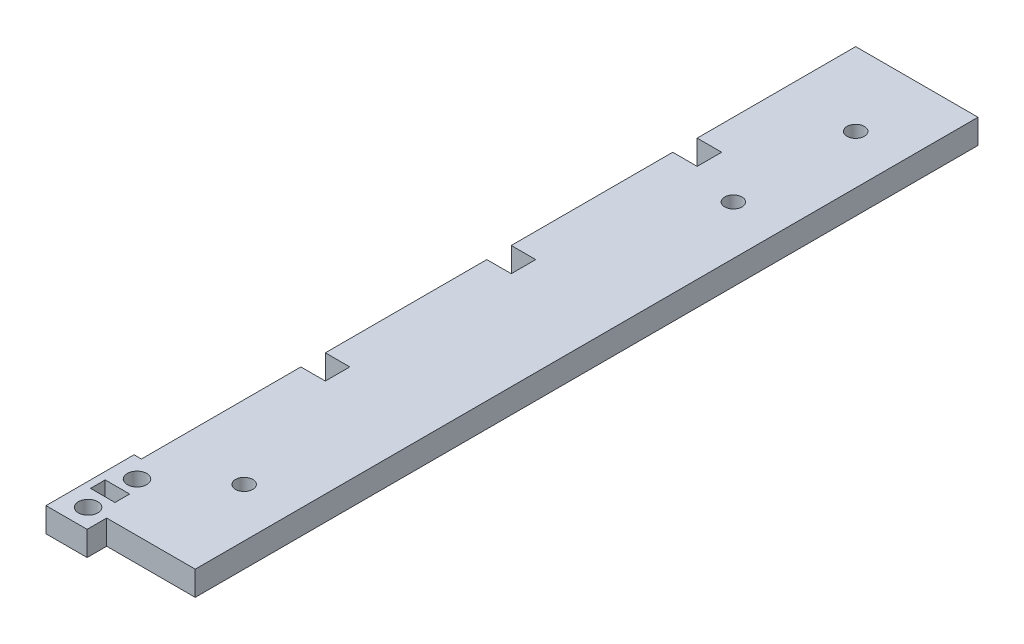
ISO-10303-21;
HEADER;
FILE_DESCRIPTION(('STEP AP214'),'2;1');
FILE_NAME('part.step','',(''),(''),'','','');
FILE_SCHEMA(('AUTOMOTIVE_DESIGN { 1 0 10303 214 1 1 1 1 }'));
ENDSEC;
DATA;
#1=APPLICATION_CONTEXT('core data for automotive mechanical design processes');
#2=APPLICATION_PROTOCOL_DEFINITION('international standard','automotive_design',2000,#1);
#3=PRODUCT_CONTEXT('',#1,'mechanical');
#4=PRODUCT('Part','Part','',(#3));
#5=PRODUCT_RELATED_PRODUCT_CATEGORY('part','',(#4));
#6=PRODUCT_DEFINITION_FORMATION('','',#4);
#7=PRODUCT_DEFINITION_CONTEXT('part definition',#1,'design');
#8=PRODUCT_DEFINITION('design','',#6,#7);
#9=PRODUCT_DEFINITION_SHAPE('','',#8);
#10=(LENGTH_UNIT() NAMED_UNIT(*) SI_UNIT(.MILLI.,.METRE.));
#11=(NAMED_UNIT(*) PLANE_ANGLE_UNIT() SI_UNIT($,.RADIAN.));
#12=(NAMED_UNIT(*) SI_UNIT($,.STERADIAN.) SOLID_ANGLE_UNIT());
#13=UNCERTAINTY_MEASURE_WITH_UNIT(LENGTH_MEASURE(1.E-05),#10,'distance_accuracy_value','');
#14=(GEOMETRIC_REPRESENTATION_CONTEXT(3) GLOBAL_UNCERTAINTY_ASSIGNED_CONTEXT((#13)) GLOBAL_UNIT_ASSIGNED_CONTEXT((#10,
#11,#12)) REPRESENTATION_CONTEXT('',''));
#15=CARTESIAN_POINT('',(0.,0.,0.));
#16=DIRECTION('',(0.,0.,1.));
#17=DIRECTION('',(1.,0.,0.));
#18=AXIS2_PLACEMENT_3D('',#15,#16,#17);
#19=CARTESIAN_POINT('',(0.,6.35,-7.44860874455731));
#20=DIRECTION('',(1.,0.,0.));
#21=DIRECTION('',(0.,0.,-1.));
#22=AXIS2_PLACEMENT_3D('',#19,#20,#21);
#23=PLANE('',#22);
#24=DIRECTION('',(0.,0.,1.));
#25=VECTOR('',#24,1.);
#26=CARTESIAN_POINT('',(0.,0.,-7.44860874455731));
#27=LINE('',#26,#25);
#28=CARTESIAN_POINT('',(0.,0.,-97.1106087445573));
#29=VERTEX_POINT('',#28);
#30=CARTESIAN_POINT('',(0.,0.,-55.2006087445573));
#31=VERTEX_POINT('',#30);
#32=EDGE_CURVE('E432',#29,#31,#27,.T.);
#33=ORIENTED_EDGE('',*,*,#32,.T.);
#34=DIRECTION('',(0.,1.,0.));
#35=VECTOR('',#34,1.);
#36=CARTESIAN_POINT('',(0.,0.,-55.2006087445573));
#37=LINE('',#36,#35);
#38=CARTESIAN_POINT('',(0.,6.35,-55.2006087445573));
#39=VERTEX_POINT('',#38);
#40=EDGE_CURVE('E265',#31,#39,#37,.T.);
#41=ORIENTED_EDGE('',*,*,#40,.T.);
#42=DIRECTION('',(0.,0.,1.));
#43=VECTOR('',#42,1.);
#44=CARTESIAN_POINT('',(0.,6.35,-7.44860874455731));
#45=LINE('',#44,#43);
#46=CARTESIAN_POINT('',(0.,6.35,-97.1106087445573));
#47=VERTEX_POINT('',#46);
#48=EDGE_CURVE('E451',#47,#39,#45,.T.);
#49=ORIENTED_EDGE('',*,*,#48,.F.);
#50=DIRECTION('',(0.,1.,0.));
#51=VECTOR('',#50,1.);
#52=CARTESIAN_POINT('',(0.,0.,-97.1106087445573));
#53=LINE('',#52,#51);
#54=EDGE_CURVE('E284',#29,#47,#53,.T.);
#55=ORIENTED_EDGE('',*,*,#54,.F.);
#56=EDGE_LOOP('',(#33,#41,#49,#55));
#57=FACE_BOUND('',#56,.T.);
#58=ADVANCED_FACE('F33',(#57),#23,.F.);
#59=CARTESIAN_POINT('',(0.,0.,-145.370608744557));
#60=VERTEX_POINT('',#59);
#61=CARTESIAN_POINT('',(0.,0.,-103.460608744557));
#62=VERTEX_POINT('',#61);
#63=EDGE_CURVE('E355',#60,#62,#27,.T.);
#64=ORIENTED_EDGE('',*,*,#63,.T.);
#65=DIRECTION('',(0.,1.,0.));
#66=VECTOR('',#65,1.);
#67=CARTESIAN_POINT('',(0.,0.,-103.460608744557));
#68=LINE('',#67,#66);
#69=CARTESIAN_POINT('',(0.,6.35,-103.460608744557));
#70=VERTEX_POINT('',#69);
#71=EDGE_CURVE('E261',#62,#70,#68,.T.);
#72=ORIENTED_EDGE('',*,*,#71,.T.);
#73=CARTESIAN_POINT('',(0.,6.35,-145.370608744557));
#74=VERTEX_POINT('',#73);
#75=EDGE_CURVE('E335',#74,#70,#45,.T.);
#76=ORIENTED_EDGE('',*,*,#75,.F.);
#77=DIRECTION('',(0.,1.,0.));
#78=VECTOR('',#77,1.);
#79=CARTESIAN_POINT('',(0.,0.,-145.370608744557));
#80=LINE('',#79,#78);
#81=EDGE_CURVE('E310',#60,#74,#80,.T.);
#82=ORIENTED_EDGE('',*,*,#81,.F.);
#83=EDGE_LOOP('',(#64,#72,#76,#82));
#84=FACE_BOUND('',#83,.T.);
#85=ADVANCED_FACE('F441',(#84),#23,.F.);
#86=CARTESIAN_POINT('',(0.,0.,-192.868608744557));
#87=VERTEX_POINT('',#86);
#88=CARTESIAN_POINT('',(0.,0.,-151.720608744557));
#89=VERTEX_POINT('',#88);
#90=EDGE_CURVE('E351',#87,#89,#27,.T.);
#91=ORIENTED_EDGE('',*,*,#90,.T.);
#92=DIRECTION('',(0.,1.,0.));
#93=VECTOR('',#92,1.);
#94=CARTESIAN_POINT('',(0.,0.,-151.720608744557));
#95=LINE('',#94,#93);
#96=CARTESIAN_POINT('',(0.,6.35,-151.720608744557));
#97=VERTEX_POINT('',#96);
#98=EDGE_CURVE('E289',#89,#97,#95,.T.);
#99=ORIENTED_EDGE('',*,*,#98,.T.);
#100=CARTESIAN_POINT('',(0.,6.35,-192.868608744557));
#101=VERTEX_POINT('',#100);
#102=EDGE_CURVE('E331',#101,#97,#45,.T.);
#103=ORIENTED_EDGE('',*,*,#102,.F.);
#104=DIRECTION('',(0.,-1.,0.));
#105=VECTOR('',#104,1.);
#106=CARTESIAN_POINT('',(0.,6.35,-192.868608744557));
#107=LINE('',#106,#105);
#108=EDGE_CURVE('E41',#101,#87,#107,.T.);
#109=ORIENTED_EDGE('',*,*,#108,.T.);
#110=EDGE_LOOP('',(#91,#99,#103,#109));
#111=FACE_BOUND('',#110,.T.);
#112=ADVANCED_FACE('F385',(#111),#23,.F.);
#113=CARTESIAN_POINT('',(31.75,6.35,10.3313912554427));
#114=DIRECTION('',(-1.,0.,0.));
#115=DIRECTION('',(0.,0.,1.));
#116=AXIS2_PLACEMENT_3D('',#113,#114,#115);
#117=PLANE('',#116);
#118=DIRECTION('',(0.,0.,-1.));
#119=VECTOR('',#118,1.);
#120=CARTESIAN_POINT('',(31.75,0.,10.3313912554427));
#121=LINE('',#120,#119);
#122=CARTESIAN_POINT('',(31.75,0.,10.3313912554427));
#123=VERTEX_POINT('',#122);
#124=CARTESIAN_POINT('',(31.75,0.,-192.868608744557));
#125=VERTEX_POINT('',#124);
#126=EDGE_CURVE('E268',#123,#125,#121,.T.);
#127=ORIENTED_EDGE('',*,*,#126,.T.);
#128=DIRECTION('',(0.,-1.,0.));
#129=VECTOR('',#128,1.);
#130=CARTESIAN_POINT('',(31.75,6.35,-192.868608744557));
#131=LINE('',#130,#129);
#132=CARTESIAN_POINT('',(31.75,6.35,-192.868608744557));
#133=VERTEX_POINT('',#132);
#134=EDGE_CURVE('E11',#133,#125,#131,.T.);
#135=ORIENTED_EDGE('',*,*,#134,.F.);
#136=DIRECTION('',(0.,0.,-1.));
#137=VECTOR('',#136,1.);
#138=CARTESIAN_POINT('',(31.75,6.35,10.3313912554427));
#139=LINE('',#138,#137);
#140=CARTESIAN_POINT('',(31.75,6.35,10.3313912554427));
#141=VERTEX_POINT('',#140);
#142=EDGE_CURVE('E324',#141,#133,#139,.T.);
#143=ORIENTED_EDGE('',*,*,#142,.F.);
#144=DIRECTION('',(0.,-1.,0.));
#145=VECTOR('',#144,1.);
#146=CARTESIAN_POINT('',(31.75,6.35,10.3313912554427));
#147=LINE('',#146,#145);
#148=EDGE_CURVE('E345',#141,#123,#147,.T.);
#149=ORIENTED_EDGE('',*,*,#148,.T.);
#150=EDGE_LOOP('',(#127,#135,#143,#149));
#151=FACE_BOUND('',#150,.T.);
#152=ADVANCED_FACE('F35',(#151),#117,.F.);
#153=CARTESIAN_POINT('',(0.,6.35,-192.868608744557));
#154=DIRECTION('',(0.,0.,1.));
#155=DIRECTION('',(1.,0.,0.));
#156=AXIS2_PLACEMENT_3D('',#153,#154,#155);
#157=PLANE('',#156);
#158=DIRECTION('',(-1.,0.,0.));
#159=VECTOR('',#158,1.);
#160=CARTESIAN_POINT('',(0.,0.,-192.868608744557));
#161=LINE('',#160,#159);
#162=EDGE_CURVE('E348',#125,#87,#161,.T.);
#163=ORIENTED_EDGE('',*,*,#162,.T.);
#164=ORIENTED_EDGE('',*,*,#108,.F.);
#165=DIRECTION('',(-1.,0.,0.));
#166=VECTOR('',#165,1.);
#167=CARTESIAN_POINT('',(0.,6.35,-192.868608744557));
#168=LINE('',#167,#166);
#169=EDGE_CURVE('E327',#133,#101,#168,.T.);
#170=ORIENTED_EDGE('',*,*,#169,.F.);
#171=ORIENTED_EDGE('',*,*,#134,.T.);
#172=EDGE_LOOP('',(#163,#164,#170,#171));
#173=FACE_BOUND('',#172,.T.);
#174=ADVANCED_FACE('F399',(#173),#157,.F.);
#175=CARTESIAN_POINT('',(0.,6.35,-48.8506087445573));
#176=VERTEX_POINT('',#175);
#177=CARTESIAN_POINT('',(0.,6.35,-7.44860874455731));
#178=VERTEX_POINT('',#177);
#179=EDGE_CURVE('E330',#176,#178,#45,.T.);
#180=ORIENTED_EDGE('',*,*,#179,.F.);
#181=DIRECTION('',(0.,1.,0.));
#182=VECTOR('',#181,1.);
#183=CARTESIAN_POINT('',(0.,0.,-48.8506087445573));
#184=LINE('',#183,#182);
#185=CARTESIAN_POINT('',(0.,0.,-48.8506087445573));
#186=VERTEX_POINT('',#185);
#187=EDGE_CURVE('E256',#186,#176,#184,.T.);
#188=ORIENTED_EDGE('',*,*,#187,.F.);
#189=CARTESIAN_POINT('',(0.,0.,-7.44860874455731));
#190=VERTEX_POINT('',#189);
#191=EDGE_CURVE('E350',#186,#190,#27,.T.);
#192=ORIENTED_EDGE('',*,*,#191,.T.);
#193=DIRECTION('',(0.,-1.,0.));
#194=VECTOR('',#193,1.);
#195=CARTESIAN_POINT('',(0.,6.35,-7.44860874455731));
#196=LINE('',#195,#194);
#197=EDGE_CURVE('E378',#178,#190,#196,.T.);
#198=ORIENTED_EDGE('',*,*,#197,.F.);
#199=EDGE_LOOP('',(#180,#188,#192,#198));
#200=FACE_BOUND('',#199,.T.);
#201=ADVANCED_FACE('F430',(#200),#23,.F.);
#202=CARTESIAN_POINT('',(-1.905,6.35,-7.44860874455731));
#203=DIRECTION('',(0.,0.,1.));
#204=DIRECTION('',(1.,0.,0.));
#205=AXIS2_PLACEMENT_3D('',#202,#203,#204);
#206=PLANE('',#205);
#207=DIRECTION('',(-1.,0.,0.));
#208=VECTOR('',#207,1.);
#209=CARTESIAN_POINT('',(-1.905,0.,-7.44860874455731));
#210=LINE('',#209,#208);
#211=CARTESIAN_POINT('',(-1.905,0.,-7.44860874455731));
#212=VERTEX_POINT('',#211);
#213=EDGE_CURVE('E354',#190,#212,#210,.T.);
#214=ORIENTED_EDGE('',*,*,#213,.T.);
#215=DIRECTION('',(0.,-1.,0.));
#216=VECTOR('',#215,1.);
#217=CARTESIAN_POINT('',(-1.905,6.35,-7.44860874455731));
#218=LINE('',#217,#216);
#219=CARTESIAN_POINT('',(-1.905,6.35,-7.44860874455731));
#220=VERTEX_POINT('',#219);
#221=EDGE_CURVE('E375',#220,#212,#218,.T.);
#222=ORIENTED_EDGE('',*,*,#221,.F.);
#223=DIRECTION('',(-1.,0.,0.));
#224=VECTOR('',#223,1.);
#225=CARTESIAN_POINT('',(-1.905,6.35,-7.44860874455731));
#226=LINE('',#225,#224);
#227=EDGE_CURVE('E334',#178,#220,#226,.T.);
#228=ORIENTED_EDGE('',*,*,#227,.F.);
#229=ORIENTED_EDGE('',*,*,#197,.T.);
#230=EDGE_LOOP('',(#214,#222,#228,#229));
#231=FACE_BOUND('',#230,.T.);
#232=ADVANCED_FACE('F426',(#231),#206,.F.);
#233=CARTESIAN_POINT('',(-1.905,6.35,15.4113912554427));
#234=DIRECTION('',(1.,0.,0.));
#235=DIRECTION('',(0.,0.,-1.));
#236=AXIS2_PLACEMENT_3D('',#233,#234,#235);
#237=PLANE('',#236);
#238=DIRECTION('',(0.,0.,1.));
#239=VECTOR('',#238,1.);
#240=CARTESIAN_POINT('',(-1.905,0.,15.4113912554427));
#241=LINE('',#240,#239);
#242=CARTESIAN_POINT('',(-1.905,0.,15.4113912554427));
#243=VERTEX_POINT('',#242);
#244=EDGE_CURVE('E357',#212,#243,#241,.T.);
#245=ORIENTED_EDGE('',*,*,#244,.T.);
#246=DIRECTION('',(0.,-1.,0.));
#247=VECTOR('',#246,1.);
#248=CARTESIAN_POINT('',(-1.905,6.35,15.4113912554427));
#249=LINE('',#248,#247);
#250=CARTESIAN_POINT('',(-1.905,6.35,15.4113912554427));
#251=VERTEX_POINT('',#250);
#252=EDGE_CURVE('E372',#251,#243,#249,.T.);
#253=ORIENTED_EDGE('',*,*,#252,.F.);
#254=DIRECTION('',(0.,0.,1.));
#255=VECTOR('',#254,1.);
#256=CARTESIAN_POINT('',(-1.905,6.35,15.4113912554427));
#257=LINE('',#256,#255);
#258=EDGE_CURVE('E337',#220,#251,#257,.T.);
#259=ORIENTED_EDGE('',*,*,#258,.F.);
#260=ORIENTED_EDGE('',*,*,#221,.T.);
#261=EDGE_LOOP('',(#245,#253,#259,#260));
#262=FACE_BOUND('',#261,.T.);
#263=ADVANCED_FACE('F421',(#262),#237,.F.);
#264=CARTESIAN_POINT('',(8.763,6.35,15.4113912554427));
#265=DIRECTION('',(0.,0.,-1.));
#266=DIRECTION('',(-1.,0.,0.));
#267=AXIS2_PLACEMENT_3D('',#264,#265,#266);
#268=PLANE('',#267);
#269=DIRECTION('',(1.,0.,0.));
#270=VECTOR('',#269,1.);
#271=CARTESIAN_POINT('',(8.763,0.,15.4113912554427));
#272=LINE('',#271,#270);
#273=CARTESIAN_POINT('',(8.763,0.,15.4113912554427));
#274=VERTEX_POINT('',#273);
#275=EDGE_CURVE('E359',#243,#274,#272,.T.);
#276=ORIENTED_EDGE('',*,*,#275,.T.);
#277=DIRECTION('',(0.,-1.,0.));
#278=VECTOR('',#277,1.);
#279=CARTESIAN_POINT('',(8.763,6.35,15.4113912554427));
#280=LINE('',#279,#278);
#281=CARTESIAN_POINT('',(8.763,6.35,15.4113912554427));
#282=VERTEX_POINT('',#281);
#283=EDGE_CURVE('E369',#282,#274,#280,.T.);
#284=ORIENTED_EDGE('',*,*,#283,.F.);
#285=DIRECTION('',(1.,0.,0.));
#286=VECTOR('',#285,1.);
#287=CARTESIAN_POINT('',(8.763,6.35,15.4113912554427));
#288=LINE('',#287,#286);
#289=EDGE_CURVE('E339',#251,#282,#288,.T.);
#290=ORIENTED_EDGE('',*,*,#289,.F.);
#291=ORIENTED_EDGE('',*,*,#252,.T.);
#292=EDGE_LOOP('',(#276,#284,#290,#291));
#293=FACE_BOUND('',#292,.T.);
#294=ADVANCED_FACE('F415',(#293),#268,.F.);
#295=CARTESIAN_POINT('',(8.763,6.35,10.3313912554427));
#296=DIRECTION('',(-1.,0.,0.));
#297=DIRECTION('',(0.,0.,1.));
#298=AXIS2_PLACEMENT_3D('',#295,#296,#297);
#299=PLANE('',#298);
#300=DIRECTION('',(0.,0.,-1.));
#301=VECTOR('',#300,1.);
#302=CARTESIAN_POINT('',(8.763,0.,10.3313912554427));
#303=LINE('',#302,#301);
#304=CARTESIAN_POINT('',(8.763,0.,10.3313912554427));
#305=VERTEX_POINT('',#304);
#306=EDGE_CURVE('E361',#274,#305,#303,.T.);
#307=ORIENTED_EDGE('',*,*,#306,.T.);
#308=DIRECTION('',(0.,-1.,0.));
#309=VECTOR('',#308,1.);
#310=CARTESIAN_POINT('',(8.763,6.35,10.3313912554427));
#311=LINE('',#310,#309);
#312=CARTESIAN_POINT('',(8.763,6.35,10.3313912554427));
#313=VERTEX_POINT('',#312);
#314=EDGE_CURVE('E366',#313,#305,#311,.T.);
#315=ORIENTED_EDGE('',*,*,#314,.F.);
#316=DIRECTION('',(0.,0.,-1.));
#317=VECTOR('',#316,1.);
#318=CARTESIAN_POINT('',(8.763,6.35,10.3313912554427));
#319=LINE('',#318,#317);
#320=EDGE_CURVE('E341',#282,#313,#319,.T.);
#321=ORIENTED_EDGE('',*,*,#320,.F.);
#322=ORIENTED_EDGE('',*,*,#283,.T.);
#323=EDGE_LOOP('',(#307,#315,#321,#322));
#324=FACE_BOUND('',#323,.T.);
#325=ADVANCED_FACE('F411',(#324),#299,.F.);
#326=CARTESIAN_POINT('',(8.763,6.35,10.3313912554427));
#327=DIRECTION('',(0.,0.,-1.));
#328=DIRECTION('',(-1.,0.,0.));
#329=AXIS2_PLACEMENT_3D('',#326,#327,#328);
#330=PLANE('',#329);
#331=DIRECTION('',(1.,0.,0.));
#332=VECTOR('',#331,1.);
#333=CARTESIAN_POINT('',(8.763,0.,10.3313912554427));
#334=LINE('',#333,#332);
#335=EDGE_CURVE('E328',#305,#123,#334,.T.);
#336=ORIENTED_EDGE('',*,*,#335,.T.);
#337=ORIENTED_EDGE('',*,*,#148,.F.);
#338=DIRECTION('',(1.,0.,0.));
#339=VECTOR('',#338,1.);
#340=CARTESIAN_POINT('',(8.763,6.35,10.3313912554427));
#341=LINE('',#340,#339);
#342=EDGE_CURVE('E343',#313,#141,#341,.T.);
#343=ORIENTED_EDGE('',*,*,#342,.F.);
#344=ORIENTED_EDGE('',*,*,#314,.T.);
#345=EDGE_LOOP('',(#336,#337,#343,#344));
#346=FACE_BOUND('',#345,.T.);
#347=ADVANCED_FACE('F406',(#346),#330,.F.);
#348=CARTESIAN_POINT('',(0.,6.35,0.));
#349=DIRECTION('',(0.,-1.,0.));
#350=DIRECTION('',(0.,0.,-1.));
#351=AXIS2_PLACEMENT_3D('',#348,#349,#350);
#352=PLANE('',#351);
#353=CARTESIAN_POINT('',(19.05,6.34999999999999,-173.818608744557));
#354=DIRECTION('',(0.,-1.,0.));
#355=DIRECTION('',(0.,0.,-1.));
#356=AXIS2_PLACEMENT_3D('',#353,#354,#355);
#357=CIRCLE('',#356,2.24790000000001);
#358=CARTESIAN_POINT('',(19.05,6.34999999999999,-176.066508744557));
#359=VERTEX_POINT('',#358);
#360=EDGE_CURVE('E802',#359,#359,#357,.T.);
#361=ORIENTED_EDGE('',*,*,#360,.T.);
#362=EDGE_LOOP('',(#361));
#363=FACE_BOUND('',#362,.T.);
#364=CARTESIAN_POINT('',(19.05,6.34999999999999,-142.068608744557));
#365=DIRECTION('',(0.,-1.,0.));
#366=DIRECTION('',(0.,0.,-1.));
#367=AXIS2_PLACEMENT_3D('',#364,#365,#366);
#368=CIRCLE('',#367,2.24790000000001);
#369=CARTESIAN_POINT('',(19.05,6.34999999999999,-144.316508744557));
#370=VERTEX_POINT('',#369);
#371=EDGE_CURVE('E814',#370,#370,#368,.T.);
#372=ORIENTED_EDGE('',*,*,#371,.T.);
#373=EDGE_LOOP('',(#372));
#374=FACE_BOUND('',#373,.T.);
#375=CARTESIAN_POINT('',(19.05,6.34999999999999,-15.0686087445573));
#376=DIRECTION('',(0.,-1.,0.));
#377=DIRECTION('',(0.,0.,-1.));
#378=AXIS2_PLACEMENT_3D('',#375,#376,#377);
#379=CIRCLE('',#378,2.24790000000001);
#380=CARTESIAN_POINT('',(19.05,6.34999999999999,-17.3165087445573));
#381=VERTEX_POINT('',#380);
#382=EDGE_CURVE('E218',#381,#381,#379,.T.);
#383=ORIENTED_EDGE('',*,*,#382,.T.);
#384=EDGE_LOOP('',(#383));
#385=FACE_BOUND('',#384,.T.);
#386=DIRECTION('',(1.,0.,0.));
#387=VECTOR('',#386,1.);
#388=CARTESIAN_POINT('',(6.35,6.35,5.75939125544268));
#389=LINE('',#388,#387);
#390=CARTESIAN_POINT('',(0.,6.35,5.75939125544268));
#391=VERTEX_POINT('',#390);
#392=CARTESIAN_POINT('',(6.35,6.35,5.75939125544268));
#393=VERTEX_POINT('',#392);
#394=EDGE_CURVE('E224',#391,#393,#389,.T.);
#395=ORIENTED_EDGE('',*,*,#394,.F.);
#396=DIRECTION('',(0.,0.,1.));
#397=VECTOR('',#396,1.);
#398=CARTESIAN_POINT('',(0.,6.35,5.75939125544268));
#399=LINE('',#398,#397);
#400=CARTESIAN_POINT('',(0.,6.35,1.94939125544268));
#401=VERTEX_POINT('',#400);
#402=EDGE_CURVE('E48',#401,#391,#399,.T.);
#403=ORIENTED_EDGE('',*,*,#402,.F.);
#404=DIRECTION('',(-1.,0.,0.));
#405=VECTOR('',#404,1.);
#406=CARTESIAN_POINT('',(0.,6.35,1.94939125544268));
#407=LINE('',#406,#405);
#408=CARTESIAN_POINT('',(6.35,6.35,1.94939125544268));
#409=VERTEX_POINT('',#408);
#410=EDGE_CURVE('E212',#409,#401,#407,.T.);
#411=ORIENTED_EDGE('',*,*,#410,.F.);
#412=DIRECTION('',(0.,0.,-1.));
#413=VECTOR('',#412,1.);
#414=CARTESIAN_POINT('',(6.35,6.35,1.94939125544268));
#415=LINE('',#414,#413);
#416=EDGE_CURVE('E215',#393,#409,#415,.T.);
#417=ORIENTED_EDGE('',*,*,#416,.F.);
#418=EDGE_LOOP('',(#395,#403,#411,#417));
#419=FACE_BOUND('',#418,.T.);
#420=CARTESIAN_POINT('',(3.937,6.35,-2.36860874455731));
#421=DIRECTION('',(0.,1.,0.));
#422=DIRECTION('',(0.,0.,1.));
#423=AXIS2_PLACEMENT_3D('',#420,#421,#422);
#424=CIRCLE('',#423,2.52729999999999);
#425=CARTESIAN_POINT('',(3.937,6.35,0.158691255442676));
#426=VERTEX_POINT('',#425);
#427=EDGE_CURVE('E230',#426,#426,#424,.T.);
#428=ORIENTED_EDGE('',*,*,#427,.F.);
#429=EDGE_LOOP('',(#428));
#430=FACE_BOUND('',#429,.T.);
#431=CARTESIAN_POINT('',(3.937,6.35,10.3313912554427));
#432=DIRECTION('',(0.,1.,0.));
#433=DIRECTION('',(0.,0.,1.));
#434=AXIS2_PLACEMENT_3D('',#431,#432,#433);
#435=CIRCLE('',#434,2.52729999999999);
#436=CARTESIAN_POINT('',(3.937,6.35,12.8586912554427));
#437=VERTEX_POINT('',#436);
#438=EDGE_CURVE('E239',#437,#437,#435,.T.);
#439=ORIENTED_EDGE('',*,*,#438,.F.);
#440=EDGE_LOOP('',(#439));
#441=FACE_BOUND('',#440,.T.);
#442=ORIENTED_EDGE('',*,*,#48,.T.);
#443=DIRECTION('',(-1.,0.,0.));
#444=VECTOR('',#443,1.);
#445=CARTESIAN_POINT('',(0.,6.35,-55.2006087445573));
#446=LINE('',#445,#444);
#447=CARTESIAN_POINT('',(6.35000000000001,6.35,-55.2006087445573));
#448=VERTEX_POINT('',#447);
#449=EDGE_CURVE('E250',#448,#39,#446,.T.);
#450=ORIENTED_EDGE('',*,*,#449,.F.);
#451=DIRECTION('',(0.,0.,-1.));
#452=VECTOR('',#451,1.);
#453=CARTESIAN_POINT('',(6.35000000000001,6.35,-55.2006087445573));
#454=LINE('',#453,#452);
#455=CARTESIAN_POINT('',(6.35,6.35,-48.8506087445573));
#456=VERTEX_POINT('',#455);
#457=EDGE_CURVE('E260',#456,#448,#454,.T.);
#458=ORIENTED_EDGE('',*,*,#457,.F.);
#459=DIRECTION('',(1.,0.,0.));
#460=VECTOR('',#459,1.);
#461=CARTESIAN_POINT('',(0.,6.35,-48.8506087445573));
#462=LINE('',#461,#460);
#463=EDGE_CURVE('E257',#176,#456,#462,.T.);
#464=ORIENTED_EDGE('',*,*,#463,.F.);
#465=ORIENTED_EDGE('',*,*,#179,.T.);
#466=ORIENTED_EDGE('',*,*,#227,.T.);
#467=ORIENTED_EDGE('',*,*,#258,.T.);
#468=ORIENTED_EDGE('',*,*,#289,.T.);
#469=ORIENTED_EDGE('',*,*,#320,.T.);
#470=ORIENTED_EDGE('',*,*,#342,.T.);
#471=ORIENTED_EDGE('',*,*,#142,.T.);
#472=ORIENTED_EDGE('',*,*,#169,.T.);
#473=ORIENTED_EDGE('',*,*,#102,.T.);
#474=DIRECTION('',(-1.,0.,0.));
#475=VECTOR('',#474,1.);
#476=CARTESIAN_POINT('',(0.,6.35,-151.720608744557));
#477=LINE('',#476,#475);
#478=CARTESIAN_POINT('',(6.34999999999995,6.35,-151.720608744557));
#479=VERTEX_POINT('',#478);
#480=EDGE_CURVE('E304',#479,#97,#477,.T.);
#481=ORIENTED_EDGE('',*,*,#480,.F.);
#482=DIRECTION('',(0.,0.,-1.));
#483=VECTOR('',#482,1.);
#484=CARTESIAN_POINT('',(6.34999999999995,6.35,-151.720608744557));
#485=LINE('',#484,#483);
#486=CARTESIAN_POINT('',(6.34999999999995,6.35,-145.370608744557));
#487=VERTEX_POINT('',#486);
#488=EDGE_CURVE('E313',#487,#479,#485,.T.);
#489=ORIENTED_EDGE('',*,*,#488,.F.);
#490=DIRECTION('',(1.,0.,0.));
#491=VECTOR('',#490,1.);
#492=CARTESIAN_POINT('',(0.,6.35,-145.370608744557));
#493=LINE('',#492,#491);
#494=EDGE_CURVE('E245',#74,#487,#493,.T.);
#495=ORIENTED_EDGE('',*,*,#494,.F.);
#496=ORIENTED_EDGE('',*,*,#75,.T.);
#497=DIRECTION('',(-1.,0.,0.));
#498=VECTOR('',#497,1.);
#499=CARTESIAN_POINT('',(0.,6.35,-103.460608744557));
#500=LINE('',#499,#498);
#501=CARTESIAN_POINT('',(6.34999999999997,6.35,-103.460608744557));
#502=VERTEX_POINT('',#501);
#503=EDGE_CURVE('E278',#502,#70,#500,.T.);
#504=ORIENTED_EDGE('',*,*,#503,.F.);
#505=DIRECTION('',(0.,0.,-1.));
#506=VECTOR('',#505,1.);
#507=CARTESIAN_POINT('',(6.34999999999997,6.35,-103.460608744557));
#508=LINE('',#507,#506);
#509=CARTESIAN_POINT('',(6.35,6.35,-97.1106087445573));
#510=VERTEX_POINT('',#509);
#511=EDGE_CURVE('E288',#510,#502,#508,.T.);
#512=ORIENTED_EDGE('',*,*,#511,.F.);
#513=DIRECTION('',(1.,0.,0.));
#514=VECTOR('',#513,1.);
#515=CARTESIAN_POINT('',(0.,6.35,-97.1106087445573));
#516=LINE('',#515,#514);
#517=EDGE_CURVE('E285',#47,#510,#516,.T.);
#518=ORIENTED_EDGE('',*,*,#517,.F.);
#519=EDGE_LOOP('',(#442,#450,#458,#464,#465,#466,#467,#468,#469,#470,#471,#472,#473,#481,#489,
#495,#496,#504,#512,#518));
#520=FACE_BOUND('',#519,.T.);
#521=ADVANCED_FACE('F395',(#363,#374,#385,#419,#430,#441,#520),#352,.F.);
#522=CARTESIAN_POINT('',(0.,0.,0.));
#523=DIRECTION('',(0.,-1.,0.));
#524=DIRECTION('',(0.,0.,-1.));
#525=AXIS2_PLACEMENT_3D('',#522,#523,#524);
#526=PLANE('',#525);
#527=CARTESIAN_POINT('',(19.05,0.,-173.818608744557));
#528=DIRECTION('',(0.,-1.,0.));
#529=DIRECTION('',(0.,0.,-1.));
#530=AXIS2_PLACEMENT_3D('',#527,#528,#529);
#531=CIRCLE('',#530,4.7625);
#532=CARTESIAN_POINT('',(19.05,0.,-178.581108744557));
#533=VERTEX_POINT('',#532);
#534=EDGE_CURVE('E795',#533,#533,#531,.T.);
#535=ORIENTED_EDGE('',*,*,#534,.F.);
#536=EDGE_LOOP('',(#535));
#537=FACE_BOUND('',#536,.T.);
#538=CARTESIAN_POINT('',(19.05,0.,-142.068608744557));
#539=DIRECTION('',(0.,-1.,0.));
#540=DIRECTION('',(0.,0.,-1.));
#541=AXIS2_PLACEMENT_3D('',#538,#539,#540);
#542=CIRCLE('',#541,4.7625);
#543=CARTESIAN_POINT('',(19.05,0.,-146.831108744557));
#544=VERTEX_POINT('',#543);
#545=EDGE_CURVE('E805',#544,#544,#542,.T.);
#546=ORIENTED_EDGE('',*,*,#545,.F.);
#547=EDGE_LOOP('',(#546));
#548=FACE_BOUND('',#547,.T.);
#549=CARTESIAN_POINT('',(19.05,0.,-15.0686087445573));
#550=DIRECTION('',(0.,-1.,0.));
#551=DIRECTION('',(0.,0.,-1.));
#552=AXIS2_PLACEMENT_3D('',#549,#550,#551);
#553=CIRCLE('',#552,4.7625);
#554=CARTESIAN_POINT('',(19.05,0.,-19.8311087445573));
#555=VERTEX_POINT('',#554);
#556=EDGE_CURVE('E817',#555,#555,#553,.T.);
#557=ORIENTED_EDGE('',*,*,#556,.F.);
#558=EDGE_LOOP('',(#557));
#559=FACE_BOUND('',#558,.T.);
#560=DIRECTION('',(0.,0.,1.));
#561=VECTOR('',#560,1.);
#562=CARTESIAN_POINT('',(0.,0.,5.75939125544268));
#563=LINE('',#562,#561);
#564=CARTESIAN_POINT('',(0.,0.,1.94939125544268));
#565=VERTEX_POINT('',#564);
#566=CARTESIAN_POINT('',(0.,0.,5.75939125544268));
#567=VERTEX_POINT('',#566);
#568=EDGE_CURVE('E196',#565,#567,#563,.T.);
#569=ORIENTED_EDGE('',*,*,#568,.T.);
#570=DIRECTION('',(1.,0.,0.));
#571=VECTOR('',#570,1.);
#572=CARTESIAN_POINT('',(6.35,0.,5.75939125544268));
#573=LINE('',#572,#571);
#574=CARTESIAN_POINT('',(6.35,0.,5.75939125544268));
#575=VERTEX_POINT('',#574);
#576=EDGE_CURVE('E205',#567,#575,#573,.T.);
#577=ORIENTED_EDGE('',*,*,#576,.T.);
#578=DIRECTION('',(0.,0.,-1.));
#579=VECTOR('',#578,1.);
#580=CARTESIAN_POINT('',(6.35,0.,1.94939125544268));
#581=LINE('',#580,#579);
#582=CARTESIAN_POINT('',(6.35,0.,1.94939125544268));
#583=VERTEX_POINT('',#582);
#584=EDGE_CURVE('E56',#575,#583,#581,.T.);
#585=ORIENTED_EDGE('',*,*,#584,.T.);
#586=DIRECTION('',(-1.,0.,0.));
#587=VECTOR('',#586,1.);
#588=CARTESIAN_POINT('',(0.,0.,1.94939125544268));
#589=LINE('',#588,#587);
#590=EDGE_CURVE('E202',#583,#565,#589,.T.);
#591=ORIENTED_EDGE('',*,*,#590,.T.);
#592=EDGE_LOOP('',(#569,#577,#585,#591));
#593=FACE_BOUND('',#592,.T.);
#594=CARTESIAN_POINT('',(3.937,0.,-2.36860874455731));
#595=DIRECTION('',(0.,1.,0.));
#596=DIRECTION('',(0.,0.,1.));
#597=AXIS2_PLACEMENT_3D('',#594,#595,#596);
#598=CIRCLE('',#597,2.52729999999999);
#599=CARTESIAN_POINT('',(3.937,0.,0.158691255442675));
#600=VERTEX_POINT('',#599);
#601=EDGE_CURVE('E236',#600,#600,#598,.T.);
#602=ORIENTED_EDGE('',*,*,#601,.T.);
#603=EDGE_LOOP('',(#602));
#604=FACE_BOUND('',#603,.T.);
#605=CARTESIAN_POINT('',(3.937,0.,10.3313912554427));
#606=DIRECTION('',(0.,1.,0.));
#607=DIRECTION('',(0.,0.,1.));
#608=AXIS2_PLACEMENT_3D('',#605,#606,#607);
#609=CIRCLE('',#608,2.52729999999999);
#610=CARTESIAN_POINT('',(3.937,0.,12.8586912554427));
#611=VERTEX_POINT('',#610);
#612=EDGE_CURVE('E242',#611,#611,#609,.T.);
#613=ORIENTED_EDGE('',*,*,#612,.T.);
#614=EDGE_LOOP('',(#613));
#615=FACE_BOUND('',#614,.T.);
#616=DIRECTION('',(-1.,0.,0.));
#617=VECTOR('',#616,1.);
#618=CARTESIAN_POINT('',(0.,0.,-55.2006087445573));
#619=LINE('',#618,#617);
#620=CARTESIAN_POINT('',(6.35000000000001,0.,-55.2006087445573));
#621=VERTEX_POINT('',#620);
#622=EDGE_CURVE('E253',#621,#31,#619,.T.);
#623=ORIENTED_EDGE('',*,*,#622,.T.);
#624=ORIENTED_EDGE('',*,*,#32,.F.);
#625=DIRECTION('',(1.,0.,0.));
#626=VECTOR('',#625,1.);
#627=CARTESIAN_POINT('',(0.,0.,-97.1106087445573));
#628=LINE('',#627,#626);
#629=CARTESIAN_POINT('',(6.35,0.,-97.1106087445573));
#630=VERTEX_POINT('',#629);
#631=EDGE_CURVE('E274',#29,#630,#628,.T.);
#632=ORIENTED_EDGE('',*,*,#631,.T.);
#633=DIRECTION('',(0.,0.,-1.));
#634=VECTOR('',#633,1.);
#635=CARTESIAN_POINT('',(6.34999999999997,0.,-103.460608744557));
#636=LINE('',#635,#634);
#637=CARTESIAN_POINT('',(6.34999999999997,0.,-103.460608744557));
#638=VERTEX_POINT('',#637);
#639=EDGE_CURVE('E277',#630,#638,#636,.T.);
#640=ORIENTED_EDGE('',*,*,#639,.T.);
#641=DIRECTION('',(-1.,0.,0.));
#642=VECTOR('',#641,1.);
#643=CARTESIAN_POINT('',(0.,0.,-103.460608744557));
#644=LINE('',#643,#642);
#645=EDGE_CURVE('E281',#638,#62,#644,.T.);
#646=ORIENTED_EDGE('',*,*,#645,.T.);
#647=ORIENTED_EDGE('',*,*,#63,.F.);
#648=DIRECTION('',(1.,0.,0.));
#649=VECTOR('',#648,1.);
#650=CARTESIAN_POINT('',(0.,0.,-145.370608744557));
#651=LINE('',#650,#649);
#652=CARTESIAN_POINT('',(6.34999999999995,0.,-145.370608744557));
#653=VERTEX_POINT('',#652);
#654=EDGE_CURVE('E300',#60,#653,#651,.T.);
#655=ORIENTED_EDGE('',*,*,#654,.T.);
#656=DIRECTION('',(0.,0.,-1.));
#657=VECTOR('',#656,1.);
#658=CARTESIAN_POINT('',(6.34999999999995,0.,-151.720608744557));
#659=LINE('',#658,#657);
#660=CARTESIAN_POINT('',(6.34999999999995,0.,-151.720608744557));
#661=VERTEX_POINT('',#660);
#662=EDGE_CURVE('E303',#653,#661,#659,.T.);
#663=ORIENTED_EDGE('',*,*,#662,.T.);
#664=DIRECTION('',(-1.,0.,0.));
#665=VECTOR('',#664,1.);
#666=CARTESIAN_POINT('',(0.,0.,-151.720608744557));
#667=LINE('',#666,#665);
#668=EDGE_CURVE('E307',#661,#89,#667,.T.);
#669=ORIENTED_EDGE('',*,*,#668,.T.);
#670=ORIENTED_EDGE('',*,*,#90,.F.);
#671=ORIENTED_EDGE('',*,*,#162,.F.);
#672=ORIENTED_EDGE('',*,*,#126,.F.);
#673=ORIENTED_EDGE('',*,*,#335,.F.);
#674=ORIENTED_EDGE('',*,*,#306,.F.);
#675=ORIENTED_EDGE('',*,*,#275,.F.);
#676=ORIENTED_EDGE('',*,*,#244,.F.);
#677=ORIENTED_EDGE('',*,*,#213,.F.);
#678=ORIENTED_EDGE('',*,*,#191,.F.);
#679=DIRECTION('',(1.,0.,0.));
#680=VECTOR('',#679,1.);
#681=CARTESIAN_POINT('',(0.,0.,-48.8506087445573));
#682=LINE('',#681,#680);
#683=CARTESIAN_POINT('',(6.35,0.,-48.8506087445573));
#684=VERTEX_POINT('',#683);
#685=EDGE_CURVE('E246',#186,#684,#682,.T.);
#686=ORIENTED_EDGE('',*,*,#685,.T.);
#687=DIRECTION('',(0.,0.,-1.));
#688=VECTOR('',#687,1.);
#689=CARTESIAN_POINT('',(6.35000000000001,0.,-55.2006087445573));
#690=LINE('',#689,#688);
#691=EDGE_CURVE('E249',#684,#621,#690,.T.);
#692=ORIENTED_EDGE('',*,*,#691,.T.);
#693=EDGE_LOOP('',(#623,#624,#632,#640,#646,#647,#655,#663,#669,#670,#671,#672,#673,#674,#675,
#676,#677,#678,#686,#692));
#694=FACE_BOUND('',#693,.T.);
#695=ADVANCED_FACE('F209',(#537,#548,#559,#593,#604,#615,#694),#526,.T.);
#696=CARTESIAN_POINT('',(0.,0.,-151.720608744557));
#697=DIRECTION('',(0.,0.,-1.));
#698=DIRECTION('',(-1.,0.,0.));
#699=AXIS2_PLACEMENT_3D('',#696,#697,#698);
#700=PLANE('',#699);
#701=ORIENTED_EDGE('',*,*,#480,.T.);
#702=ORIENTED_EDGE('',*,*,#98,.F.);
#703=ORIENTED_EDGE('',*,*,#668,.F.);
#704=DIRECTION('',(0.,1.,0.));
#705=VECTOR('',#704,1.);
#706=CARTESIAN_POINT('',(6.34999999999995,0.,-151.720608744557));
#707=LINE('',#706,#705);
#708=EDGE_CURVE('E319',#661,#479,#707,.T.);
#709=ORIENTED_EDGE('',*,*,#708,.T.);
#710=EDGE_LOOP('',(#701,#702,#703,#709));
#711=FACE_BOUND('',#710,.T.);
#712=ADVANCED_FACE('F391',(#711),#700,.F.);
#713=CARTESIAN_POINT('',(6.34999999999995,0.,-151.720608744557));
#714=DIRECTION('',(1.,0.,0.));
#715=DIRECTION('',(0.,0.,-1.));
#716=AXIS2_PLACEMENT_3D('',#713,#714,#715);
#717=PLANE('',#716);
#718=ORIENTED_EDGE('',*,*,#488,.T.);
#719=ORIENTED_EDGE('',*,*,#708,.F.);
#720=ORIENTED_EDGE('',*,*,#662,.F.);
#721=DIRECTION('',(0.,1.,0.));
#722=VECTOR('',#721,1.);
#723=CARTESIAN_POINT('',(6.34999999999995,0.,-145.370608744557));
#724=LINE('',#723,#722);
#725=EDGE_CURVE('E321',#653,#487,#724,.T.);
#726=ORIENTED_EDGE('',*,*,#725,.T.);
#727=EDGE_LOOP('',(#718,#719,#720,#726));
#728=FACE_BOUND('',#727,.T.);
#729=ADVANCED_FACE('F567',(#728),#717,.F.);
#730=CARTESIAN_POINT('',(0.,0.,-145.370608744557));
#731=DIRECTION('',(0.,0.,1.));
#732=DIRECTION('',(1.,0.,0.));
#733=AXIS2_PLACEMENT_3D('',#730,#731,#732);
#734=PLANE('',#733);
#735=ORIENTED_EDGE('',*,*,#494,.T.);
#736=ORIENTED_EDGE('',*,*,#725,.F.);
#737=ORIENTED_EDGE('',*,*,#654,.F.);
#738=ORIENTED_EDGE('',*,*,#81,.T.);
#739=EDGE_LOOP('',(#735,#736,#737,#738));
#740=FACE_BOUND('',#739,.T.);
#741=ADVANCED_FACE('F476',(#740),#734,.F.);
#742=CARTESIAN_POINT('',(0.,0.,-103.460608744557));
#743=DIRECTION('',(0.,0.,-1.));
#744=DIRECTION('',(-1.,0.,0.));
#745=AXIS2_PLACEMENT_3D('',#742,#743,#744);
#746=PLANE('',#745);
#747=ORIENTED_EDGE('',*,*,#503,.T.);
#748=ORIENTED_EDGE('',*,*,#71,.F.);
#749=ORIENTED_EDGE('',*,*,#645,.F.);
#750=DIRECTION('',(0.,1.,0.));
#751=VECTOR('',#750,1.);
#752=CARTESIAN_POINT('',(6.34999999999997,0.,-103.460608744557));
#753=LINE('',#752,#751);
#754=EDGE_CURVE('E295',#638,#502,#753,.T.);
#755=ORIENTED_EDGE('',*,*,#754,.T.);
#756=EDGE_LOOP('',(#747,#748,#749,#755));
#757=FACE_BOUND('',#756,.T.);
#758=ADVANCED_FACE('F446',(#757),#746,.F.);
#759=CARTESIAN_POINT('',(6.34999999999997,0.,-103.460608744557));
#760=DIRECTION('',(1.,0.,0.));
#761=DIRECTION('',(0.,0.,-1.));
#762=AXIS2_PLACEMENT_3D('',#759,#760,#761);
#763=PLANE('',#762);
#764=ORIENTED_EDGE('',*,*,#511,.T.);
#765=ORIENTED_EDGE('',*,*,#754,.F.);
#766=ORIENTED_EDGE('',*,*,#639,.F.);
#767=DIRECTION('',(0.,1.,0.));
#768=VECTOR('',#767,1.);
#769=CARTESIAN_POINT('',(6.35,0.,-97.1106087445573));
#770=LINE('',#769,#768);
#771=EDGE_CURVE('E297',#630,#510,#770,.T.);
#772=ORIENTED_EDGE('',*,*,#771,.T.);
#773=EDGE_LOOP('',(#764,#765,#766,#772));
#774=FACE_BOUND('',#773,.T.);
#775=ADVANCED_FACE('F468',(#774),#763,.F.);
#776=CARTESIAN_POINT('',(0.,0.,-97.1106087445573));
#777=DIRECTION('',(0.,0.,1.));
#778=DIRECTION('',(1.,0.,0.));
#779=AXIS2_PLACEMENT_3D('',#776,#777,#778);
#780=PLANE('',#779);
#781=ORIENTED_EDGE('',*,*,#517,.T.);
#782=ORIENTED_EDGE('',*,*,#771,.F.);
#783=ORIENTED_EDGE('',*,*,#631,.F.);
#784=ORIENTED_EDGE('',*,*,#54,.T.);
#785=EDGE_LOOP('',(#781,#782,#783,#784));
#786=FACE_BOUND('',#785,.T.);
#787=ADVANCED_FACE('F466',(#786),#780,.F.);
#788=CARTESIAN_POINT('',(0.,0.,-55.2006087445573));
#789=DIRECTION('',(0.,0.,-1.));
#790=DIRECTION('',(-1.,0.,0.));
#791=AXIS2_PLACEMENT_3D('',#788,#789,#790);
#792=PLANE('',#791);
#793=ORIENTED_EDGE('',*,*,#449,.T.);
#794=ORIENTED_EDGE('',*,*,#40,.F.);
#795=ORIENTED_EDGE('',*,*,#622,.F.);
#796=DIRECTION('',(0.,1.,0.));
#797=VECTOR('',#796,1.);
#798=CARTESIAN_POINT('',(6.35000000000001,0.,-55.2006087445573));
#799=LINE('',#798,#797);
#800=EDGE_CURVE('E269',#621,#448,#799,.T.);
#801=ORIENTED_EDGE('',*,*,#800,.T.);
#802=EDGE_LOOP('',(#793,#794,#795,#801));
#803=FACE_BOUND('',#802,.T.);
#804=ADVANCED_FACE('F463',(#803),#792,.F.);
#805=CARTESIAN_POINT('',(6.35000000000001,0.,-55.2006087445573));
#806=DIRECTION('',(1.,0.,0.));
#807=DIRECTION('',(0.,0.,-1.));
#808=AXIS2_PLACEMENT_3D('',#805,#806,#807);
#809=PLANE('',#808);
#810=ORIENTED_EDGE('',*,*,#457,.T.);
#811=ORIENTED_EDGE('',*,*,#800,.F.);
#812=ORIENTED_EDGE('',*,*,#691,.F.);
#813=DIRECTION('',(0.,1.,0.));
#814=VECTOR('',#813,1.);
#815=CARTESIAN_POINT('',(6.35,0.,-48.8506087445573));
#816=LINE('',#815,#814);
#817=EDGE_CURVE('E271',#684,#456,#816,.T.);
#818=ORIENTED_EDGE('',*,*,#817,.T.);
#819=EDGE_LOOP('',(#810,#811,#812,#818));
#820=FACE_BOUND('',#819,.T.);
#821=ADVANCED_FACE('F461',(#820),#809,.F.);
#822=CARTESIAN_POINT('',(0.,0.,-48.8506087445573));
#823=DIRECTION('',(0.,0.,1.));
#824=DIRECTION('',(1.,0.,0.));
#825=AXIS2_PLACEMENT_3D('',#822,#823,#824);
#826=PLANE('',#825);
#827=ORIENTED_EDGE('',*,*,#463,.T.);
#828=ORIENTED_EDGE('',*,*,#817,.F.);
#829=ORIENTED_EDGE('',*,*,#685,.F.);
#830=ORIENTED_EDGE('',*,*,#187,.T.);
#831=EDGE_LOOP('',(#827,#828,#829,#830));
#832=FACE_BOUND('',#831,.T.);
#833=ADVANCED_FACE('F458',(#832),#826,.F.);
#834=CARTESIAN_POINT('',(3.937,6.35,10.3313912554427));
#835=DIRECTION('',(0.,1.,0.));
#836=DIRECTION('',(0.,0.,1.));
#837=AXIS2_PLACEMENT_3D('',#834,#835,#836);
#838=CYLINDRICAL_SURFACE('',#837,2.52729999999999);
#839=ORIENTED_EDGE('',*,*,#612,.F.);
#840=EDGE_LOOP('',(#839));
#841=FACE_BOUND('',#840,.T.);
#842=ORIENTED_EDGE('',*,*,#438,.T.);
#843=EDGE_LOOP('',(#842));
#844=FACE_BOUND('',#843,.T.);
#845=ADVANCED_FACE('F627',(#841,#844),#838,.F.);
#846=CARTESIAN_POINT('',(3.937,6.35,-2.36860874455731));
#847=DIRECTION('',(0.,1.,0.));
#848=DIRECTION('',(0.,0.,1.));
#849=AXIS2_PLACEMENT_3D('',#846,#847,#848);
#850=CYLINDRICAL_SURFACE('',#849,2.52729999999999);
#851=ORIENTED_EDGE('',*,*,#601,.F.);
#852=EDGE_LOOP('',(#851));
#853=FACE_BOUND('',#852,.T.);
#854=ORIENTED_EDGE('',*,*,#427,.T.);
#855=EDGE_LOOP('',(#854));
#856=FACE_BOUND('',#855,.T.);
#857=ADVANCED_FACE('F636',(#853,#856),#850,.F.);
#858=CARTESIAN_POINT('',(0.,0.,5.75939125544268));
#859=DIRECTION('',(-1.,0.,0.));
#860=DIRECTION('',(0.,0.,1.));
#861=AXIS2_PLACEMENT_3D('',#858,#859,#860);
#862=PLANE('',#861);
#863=ORIENTED_EDGE('',*,*,#402,.T.);
#864=DIRECTION('',(0.,1.,0.));
#865=VECTOR('',#864,1.);
#866=CARTESIAN_POINT('',(0.,0.,5.75939125544268));
#867=LINE('',#866,#865);
#868=EDGE_CURVE('E192',#567,#391,#867,.T.);
#869=ORIENTED_EDGE('',*,*,#868,.F.);
#870=ORIENTED_EDGE('',*,*,#568,.F.);
#871=DIRECTION('',(0.,1.,0.));
#872=VECTOR('',#871,1.);
#873=CARTESIAN_POINT('',(0.,0.,1.94939125544268));
#874=LINE('',#873,#872);
#875=EDGE_CURVE('E228',#565,#401,#874,.T.);
#876=ORIENTED_EDGE('',*,*,#875,.T.);
#877=EDGE_LOOP('',(#863,#869,#870,#876));
#878=FACE_BOUND('',#877,.T.);
#879=ADVANCED_FACE('F194',(#878),#862,.F.);
#880=CARTESIAN_POINT('',(0.,0.,1.94939125544268));
#881=DIRECTION('',(0.,0.,-1.));
#882=DIRECTION('',(-1.,0.,0.));
#883=AXIS2_PLACEMENT_3D('',#880,#881,#882);
#884=PLANE('',#883);
#885=ORIENTED_EDGE('',*,*,#410,.T.);
#886=ORIENTED_EDGE('',*,*,#875,.F.);
#887=ORIENTED_EDGE('',*,*,#590,.F.);
#888=DIRECTION('',(0.,1.,0.));
#889=VECTOR('',#888,1.);
#890=CARTESIAN_POINT('',(6.35,0.,1.94939125544268));
#891=LINE('',#890,#889);
#892=EDGE_CURVE('E231',#583,#409,#891,.T.);
#893=ORIENTED_EDGE('',*,*,#892,.T.);
#894=EDGE_LOOP('',(#885,#886,#887,#893));
#895=FACE_BOUND('',#894,.T.);
#896=ADVANCED_FACE('F655',(#895),#884,.F.);
#897=CARTESIAN_POINT('',(6.35,0.,1.94939125544268));
#898=DIRECTION('',(1.,0.,0.));
#899=DIRECTION('',(0.,0.,-1.));
#900=AXIS2_PLACEMENT_3D('',#897,#898,#899);
#901=PLANE('',#900);
#902=ORIENTED_EDGE('',*,*,#416,.T.);
#903=ORIENTED_EDGE('',*,*,#892,.F.);
#904=ORIENTED_EDGE('',*,*,#584,.F.);
#905=DIRECTION('',(0.,1.,0.));
#906=VECTOR('',#905,1.);
#907=CARTESIAN_POINT('',(6.35,0.,5.75939125544268));
#908=LINE('',#907,#906);
#909=EDGE_CURVE('E201',#575,#393,#908,.T.);
#910=ORIENTED_EDGE('',*,*,#909,.T.);
#911=EDGE_LOOP('',(#902,#903,#904,#910));
#912=FACE_BOUND('',#911,.T.);
#913=ADVANCED_FACE('F664',(#912),#901,.F.);
#914=CARTESIAN_POINT('',(6.35,0.,5.75939125544268));
#915=DIRECTION('',(0.,0.,1.));
#916=DIRECTION('',(1.,0.,0.));
#917=AXIS2_PLACEMENT_3D('',#914,#915,#916);
#918=PLANE('',#917);
#919=ORIENTED_EDGE('',*,*,#394,.T.);
#920=ORIENTED_EDGE('',*,*,#909,.F.);
#921=ORIENTED_EDGE('',*,*,#576,.F.);
#922=ORIENTED_EDGE('',*,*,#868,.T.);
#923=EDGE_LOOP('',(#919,#920,#921,#922));
#924=FACE_BOUND('',#923,.T.);
#925=ADVANCED_FACE('F206',(#924),#918,.F.);
#926=CARTESIAN_POINT('',(19.05,0.,-15.0686087445573));
#927=DIRECTION('',(0.,-1.,0.));
#928=DIRECTION('',(0.,0.,-1.));
#929=AXIS2_PLACEMENT_3D('',#926,#927,#928);
#930=CYLINDRICAL_SURFACE('',#929,2.24790000000001);
#931=ORIENTED_EDGE('',*,*,#382,.F.);
#932=EDGE_LOOP('',(#931));
#933=FACE_BOUND('',#932,.T.);
#934=CARTESIAN_POINT('',(19.05,3.175,-15.0686087445573));
#935=DIRECTION('',(0.,-1.,0.));
#936=DIRECTION('',(0.,0.,-1.));
#937=AXIS2_PLACEMENT_3D('',#934,#935,#936);
#938=CIRCLE('',#937,2.2479);
#939=CARTESIAN_POINT('',(19.05,3.175,-17.3165087445573));
#940=VERTEX_POINT('',#939);
#941=EDGE_CURVE('E822',#940,#940,#938,.T.);
#942=ORIENTED_EDGE('',*,*,#941,.T.);
#943=EDGE_LOOP('',(#942));
#944=FACE_BOUND('',#943,.T.);
#945=ADVANCED_FACE('F682',(#933,#944),#930,.F.);
#946=CARTESIAN_POINT('',(21.2979,3.175,-15.0686087445573));
#947=DIRECTION('',(0.,1.,0.));
#948=DIRECTION('',(0.,0.,1.));
#949=AXIS2_PLACEMENT_3D('',#946,#947,#948);
#950=PLANE('',#949);
#951=ORIENTED_EDGE('',*,*,#941,.F.);
#952=EDGE_LOOP('',(#951));
#953=FACE_BOUND('',#952,.T.);
#954=CARTESIAN_POINT('',(19.05,3.175,-15.0686087445573));
#955=DIRECTION('',(0.,-1.,0.));
#956=DIRECTION('',(0.,0.,-1.));
#957=AXIS2_PLACEMENT_3D('',#954,#955,#956);
#958=CIRCLE('',#957,4.7625);
#959=CARTESIAN_POINT('',(19.05,3.175,-19.8311087445573));
#960=VERTEX_POINT('',#959);
#961=EDGE_CURVE('E820',#960,#960,#958,.T.);
#962=ORIENTED_EDGE('',*,*,#961,.T.);
#963=EDGE_LOOP('',(#962));
#964=FACE_BOUND('',#963,.T.);
#965=ADVANCED_FACE('F705',(#953,#964),#950,.F.);
#966=CARTESIAN_POINT('',(19.05,0.,-15.0686087445573));
#967=DIRECTION('',(0.,-1.,0.));
#968=DIRECTION('',(0.,0.,-1.));
#969=AXIS2_PLACEMENT_3D('',#966,#967,#968);
#970=CYLINDRICAL_SURFACE('',#969,4.7625);
#971=ORIENTED_EDGE('',*,*,#961,.F.);
#972=EDGE_LOOP('',(#971));
#973=FACE_BOUND('',#972,.T.);
#974=ORIENTED_EDGE('',*,*,#556,.T.);
#975=EDGE_LOOP('',(#974));
#976=FACE_BOUND('',#975,.T.);
#977=ADVANCED_FACE('F715',(#973,#976),#970,.F.);
#978=CARTESIAN_POINT('',(19.05,0.,-142.068608744557));
#979=DIRECTION('',(0.,-1.,0.));
#980=DIRECTION('',(0.,0.,-1.));
#981=AXIS2_PLACEMENT_3D('',#978,#979,#980);
#982=CYLINDRICAL_SURFACE('',#981,2.24790000000001);
#983=ORIENTED_EDGE('',*,*,#371,.F.);
#984=EDGE_LOOP('',(#983));
#985=FACE_BOUND('',#984,.T.);
#986=CARTESIAN_POINT('',(19.05,3.175,-142.068608744557));
#987=DIRECTION('',(0.,-1.,0.));
#988=DIRECTION('',(0.,0.,-1.));
#989=AXIS2_PLACEMENT_3D('',#986,#987,#988);
#990=CIRCLE('',#989,2.2479);
#991=CARTESIAN_POINT('',(19.05,3.175,-144.316508744557));
#992=VERTEX_POINT('',#991);
#993=EDGE_CURVE('E811',#992,#992,#990,.T.);
#994=ORIENTED_EDGE('',*,*,#993,.T.);
#995=EDGE_LOOP('',(#994));
#996=FACE_BOUND('',#995,.T.);
#997=ADVANCED_FACE('F725',(#985,#996),#982,.F.);
#998=CARTESIAN_POINT('',(21.2979,3.175,-142.068608744557));
#999=DIRECTION('',(0.,1.,0.));
#1000=DIRECTION('',(0.,0.,1.));
#1001=AXIS2_PLACEMENT_3D('',#998,#999,#1000);
#1002=PLANE('',#1001);
#1003=ORIENTED_EDGE('',*,*,#993,.F.);
#1004=EDGE_LOOP('',(#1003));
#1005=FACE_BOUND('',#1004,.T.);
#1006=CARTESIAN_POINT('',(19.05,3.175,-142.068608744557));
#1007=DIRECTION('',(0.,-1.,0.));
#1008=DIRECTION('',(0.,0.,-1.));
#1009=AXIS2_PLACEMENT_3D('',#1006,#1007,#1008);
#1010=CIRCLE('',#1009,4.7625);
#1011=CARTESIAN_POINT('',(19.05,3.175,-146.831108744557));
#1012=VERTEX_POINT('',#1011);
#1013=EDGE_CURVE('E808',#1012,#1012,#1010,.T.);
#1014=ORIENTED_EDGE('',*,*,#1013,.T.);
#1015=EDGE_LOOP('',(#1014));
#1016=FACE_BOUND('',#1015,.T.);
#1017=ADVANCED_FACE('F735',(#1005,#1016),#1002,.F.);
#1018=CARTESIAN_POINT('',(19.05,0.,-142.068608744557));
#1019=DIRECTION('',(0.,-1.,0.));
#1020=DIRECTION('',(0.,0.,-1.));
#1021=AXIS2_PLACEMENT_3D('',#1018,#1019,#1020);
#1022=CYLINDRICAL_SURFACE('',#1021,4.7625);
#1023=ORIENTED_EDGE('',*,*,#1013,.F.);
#1024=EDGE_LOOP('',(#1023));
#1025=FACE_BOUND('',#1024,.T.);
#1026=ORIENTED_EDGE('',*,*,#545,.T.);
#1027=EDGE_LOOP('',(#1026));
#1028=FACE_BOUND('',#1027,.T.);
#1029=ADVANCED_FACE('F745',(#1025,#1028),#1022,.F.);
#1030=CARTESIAN_POINT('',(19.05,0.,-173.818608744557));
#1031=DIRECTION('',(0.,-1.,0.));
#1032=DIRECTION('',(0.,0.,-1.));
#1033=AXIS2_PLACEMENT_3D('',#1030,#1031,#1032);
#1034=CYLINDRICAL_SURFACE('',#1033,2.24790000000001);
#1035=ORIENTED_EDGE('',*,*,#360,.F.);
#1036=EDGE_LOOP('',(#1035));
#1037=FACE_BOUND('',#1036,.T.);
#1038=CARTESIAN_POINT('',(19.05,3.175,-173.818608744557));
#1039=DIRECTION('',(0.,-1.,0.));
#1040=DIRECTION('',(0.,0.,-1.));
#1041=AXIS2_PLACEMENT_3D('',#1038,#1039,#1040);
#1042=CIRCLE('',#1041,2.2479);
#1043=CARTESIAN_POINT('',(19.05,3.175,-176.066508744557));
#1044=VERTEX_POINT('',#1043);
#1045=EDGE_CURVE('E797',#1044,#1044,#1042,.T.);
#1046=ORIENTED_EDGE('',*,*,#1045,.T.);
#1047=EDGE_LOOP('',(#1046));
#1048=FACE_BOUND('',#1047,.T.);
#1049=ADVANCED_FACE('F755',(#1037,#1048),#1034,.F.);
#1050=CARTESIAN_POINT('',(21.2979,3.175,-173.818608744557));
#1051=DIRECTION('',(0.,1.,0.));
#1052=DIRECTION('',(0.,0.,1.));
#1053=AXIS2_PLACEMENT_3D('',#1050,#1051,#1052);
#1054=PLANE('',#1053);
#1055=ORIENTED_EDGE('',*,*,#1045,.F.);
#1056=EDGE_LOOP('',(#1055));
#1057=FACE_BOUND('',#1056,.T.);
#1058=CARTESIAN_POINT('',(19.05,3.175,-173.818608744557));
#1059=DIRECTION('',(0.,-1.,0.));
#1060=DIRECTION('',(0.,0.,-1.));
#1061=AXIS2_PLACEMENT_3D('',#1058,#1059,#1060);
#1062=CIRCLE('',#1061,4.7625);
#1063=CARTESIAN_POINT('',(19.05,3.175,-178.581108744557));
#1064=VERTEX_POINT('',#1063);
#1065=EDGE_CURVE('E792',#1064,#1064,#1062,.T.);
#1066=ORIENTED_EDGE('',*,*,#1065,.T.);
#1067=EDGE_LOOP('',(#1066));
#1068=FACE_BOUND('',#1067,.T.);
#1069=ADVANCED_FACE('F765',(#1057,#1068),#1054,.F.);
#1070=CARTESIAN_POINT('',(19.05,0.,-173.818608744557));
#1071=DIRECTION('',(0.,-1.,0.));
#1072=DIRECTION('',(0.,0.,-1.));
#1073=AXIS2_PLACEMENT_3D('',#1070,#1071,#1072);
#1074=CYLINDRICAL_SURFACE('',#1073,4.7625);
#1075=ORIENTED_EDGE('',*,*,#1065,.F.);
#1076=EDGE_LOOP('',(#1075));
#1077=FACE_BOUND('',#1076,.T.);
#1078=ORIENTED_EDGE('',*,*,#534,.T.);
#1079=EDGE_LOOP('',(#1078));
#1080=FACE_BOUND('',#1079,.T.);
#1081=ADVANCED_FACE('F775',(#1077,#1080),#1074,.F.);
#1082=CLOSED_SHELL('',(#58,#85,#112,#152,#174,#201,#232,#263,#294,#325,#347,#521,#695,#712,#729,
#741,#758,#775,#787,#804,#821,#833,#845,#857,#879,#896,#913,#925,#945,#965,#977,#997,#1017,
#1029,#1049,#1069,#1081));
#1083=MANIFOLD_SOLID_BREP('B2',#1082);
#1084=ADVANCED_BREP_SHAPE_REPRESENTATION('',(#18,#1083),#14);
#1085=SHAPE_DEFINITION_REPRESENTATION(#9,#1084);
ENDSEC;
END-ISO-10303-21;
